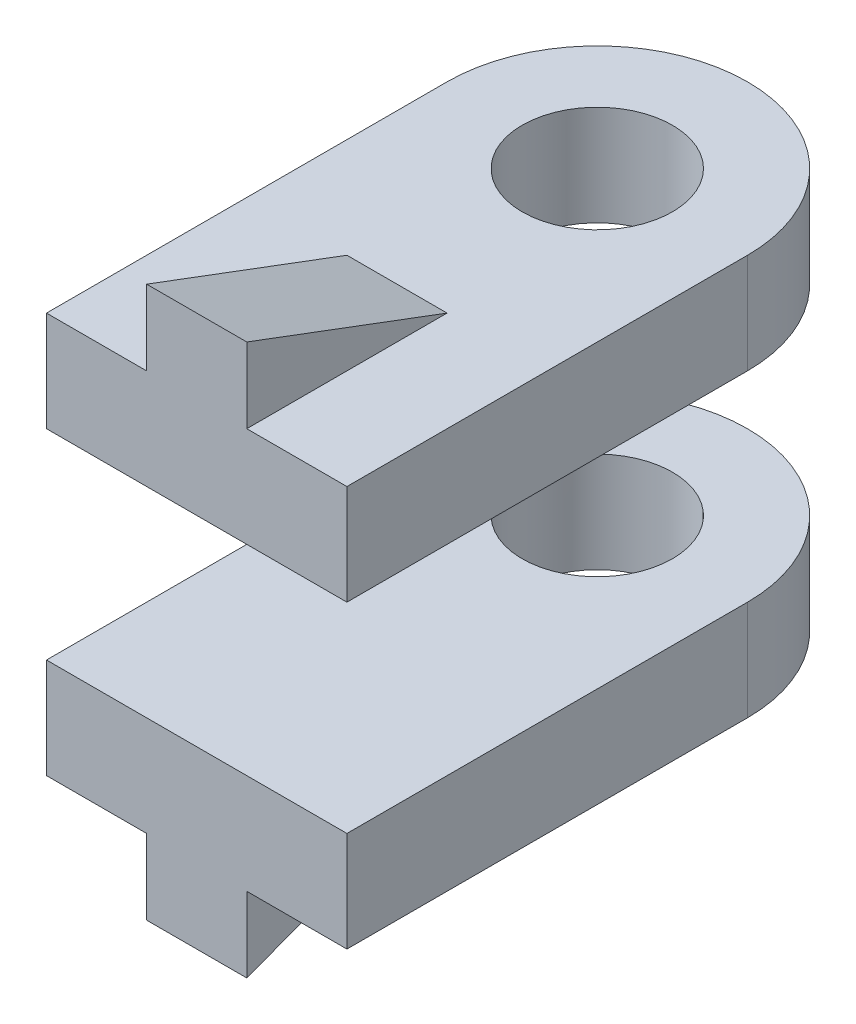
ISO-10303-21;
HEADER;
FILE_DESCRIPTION(('STEP AP214'),'2;1');
FILE_NAME('part.step','',(''),(''),'','','');
FILE_SCHEMA(('AUTOMOTIVE_DESIGN { 1 0 10303 214 1 1 1 1 }'));
ENDSEC;
DATA;
#1=APPLICATION_CONTEXT('core data for automotive mechanical design processes');
#2=APPLICATION_PROTOCOL_DEFINITION('international standard','automotive_design',2000,#1);
#3=PRODUCT_CONTEXT('',#1,'mechanical');
#4=PRODUCT('Part','Part','',(#3));
#5=PRODUCT_RELATED_PRODUCT_CATEGORY('part','',(#4));
#6=PRODUCT_DEFINITION_FORMATION('','',#4);
#7=PRODUCT_DEFINITION_CONTEXT('part definition',#1,'design');
#8=PRODUCT_DEFINITION('design','',#6,#7);
#9=PRODUCT_DEFINITION_SHAPE('','',#8);
#10=(LENGTH_UNIT() NAMED_UNIT(*) SI_UNIT(.MILLI.,.METRE.));
#11=(NAMED_UNIT(*) PLANE_ANGLE_UNIT() SI_UNIT($,.RADIAN.));
#12=(NAMED_UNIT(*) SI_UNIT($,.STERADIAN.) SOLID_ANGLE_UNIT());
#13=UNCERTAINTY_MEASURE_WITH_UNIT(LENGTH_MEASURE(1.E-05),#10,'distance_accuracy_value','');
#14=(GEOMETRIC_REPRESENTATION_CONTEXT(3) GLOBAL_UNCERTAINTY_ASSIGNED_CONTEXT((#13)) GLOBAL_UNIT_ASSIGNED_CONTEXT((#10,
#11,#12)) REPRESENTATION_CONTEXT('',''));
#15=CARTESIAN_POINT('',(0.,0.,0.));
#16=DIRECTION('',(0.,0.,1.));
#17=DIRECTION('',(1.,0.,0.));
#18=AXIS2_PLACEMENT_3D('',#15,#16,#17);
#19=CARTESIAN_POINT('',(-30.,40.,0.));
#20=DIRECTION('',(0.,0.,-1.));
#21=DIRECTION('',(-1.,0.,0.));
#22=AXIS2_PLACEMENT_3D('',#19,#20,#21);
#23=PLANE('',#22);
#24=DIRECTION('',(0.,-1.,0.));
#25=VECTOR('',#24,1.);
#26=CARTESIAN_POINT('',(-30.,40.,0.));
#27=LINE('',#26,#25);
#28=CARTESIAN_POINT('',(-30.,40.,0.));
#29=VERTEX_POINT('',#28);
#30=CARTESIAN_POINT('',(-30.,20.,0.));
#31=VERTEX_POINT('',#30);
#32=EDGE_CURVE('E51',#29,#31,#27,.T.);
#33=ORIENTED_EDGE('',*,*,#32,.T.);
#34=DIRECTION('',(-1.,0.,0.));
#35=VECTOR('',#34,1.);
#36=CARTESIAN_POINT('',(30.,20.,0.));
#37=LINE('',#36,#35);
#38=CARTESIAN_POINT('',(30.,20.,0.));
#39=VERTEX_POINT('',#38);
#40=EDGE_CURVE('E12',#39,#31,#37,.T.);
#41=ORIENTED_EDGE('',*,*,#40,.F.);
#42=DIRECTION('',(0.,-1.,0.));
#43=VECTOR('',#42,1.);
#44=CARTESIAN_POINT('',(30.,40.,0.));
#45=LINE('',#44,#43);
#46=CARTESIAN_POINT('',(30.,40.,0.));
#47=VERTEX_POINT('',#46);
#48=EDGE_CURVE('E164',#47,#39,#45,.T.);
#49=ORIENTED_EDGE('',*,*,#48,.F.);
#50=DIRECTION('',(1.,0.,0.));
#51=VECTOR('',#50,1.);
#52=CARTESIAN_POINT('',(-30.,40.,0.));
#53=LINE('',#52,#51);
#54=CARTESIAN_POINT('',(10.,40.,0.));
#55=VERTEX_POINT('',#54);
#56=EDGE_CURVE('E100',#55,#47,#53,.T.);
#57=ORIENTED_EDGE('',*,*,#56,.F.);
#58=DIRECTION('',(0.,1.,0.));
#59=VECTOR('',#58,1.);
#60=CARTESIAN_POINT('',(10.,40.,0.));
#61=LINE('',#60,#59);
#62=CARTESIAN_POINT('',(10.,55.,0.));
#63=VERTEX_POINT('',#62);
#64=EDGE_CURVE('E136',#55,#63,#61,.T.);
#65=ORIENTED_EDGE('',*,*,#64,.T.);
#66=DIRECTION('',(1.,0.,0.));
#67=VECTOR('',#66,1.);
#68=CARTESIAN_POINT('',(-10.,55.,0.));
#69=LINE('',#68,#67);
#70=CARTESIAN_POINT('',(-10.,55.,0.));
#71=VERTEX_POINT('',#70);
#72=EDGE_CURVE('E121',#71,#63,#69,.T.);
#73=ORIENTED_EDGE('',*,*,#72,.F.);
#74=DIRECTION('',(0.,1.,0.));
#75=VECTOR('',#74,1.);
#76=CARTESIAN_POINT('',(-10.,40.,0.));
#77=LINE('',#76,#75);
#78=CARTESIAN_POINT('',(-10.,40.,0.));
#79=VERTEX_POINT('',#78);
#80=EDGE_CURVE('E127',#79,#71,#77,.T.);
#81=ORIENTED_EDGE('',*,*,#80,.F.);
#82=EDGE_CURVE('E153',#29,#79,#53,.T.);
#83=ORIENTED_EDGE('',*,*,#82,.F.);
#84=EDGE_LOOP('',(#33,#41,#49,#57,#65,#73,#81,#83));
#85=FACE_BOUND('',#84,.T.);
#86=ADVANCED_FACE('F47',(#85),#23,.F.);
#87=CARTESIAN_POINT('',(30.,40.,0.));
#88=DIRECTION('',(-1.,0.,0.));
#89=DIRECTION('',(0.,0.,1.));
#90=AXIS2_PLACEMENT_3D('',#87,#88,#89);
#91=PLANE('',#90);
#92=ORIENTED_EDGE('',*,*,#48,.T.);
#93=DIRECTION('',(0.,0.,1.));
#94=VECTOR('',#93,1.);
#95=CARTESIAN_POINT('',(30.,20.,-110.));
#96=LINE('',#95,#94);
#97=CARTESIAN_POINT('',(30.,20.,-80.));
#98=VERTEX_POINT('',#97);
#99=EDGE_CURVE('E56',#98,#39,#96,.T.);
#100=ORIENTED_EDGE('',*,*,#99,.F.);
#101=DIRECTION('',(0.,-1.,0.));
#102=VECTOR('',#101,1.);
#103=CARTESIAN_POINT('',(30.,40.,-80.));
#104=LINE('',#103,#102);
#105=CARTESIAN_POINT('',(30.,40.,-80.));
#106=VERTEX_POINT('',#105);
#107=EDGE_CURVE('E148',#106,#98,#104,.T.);
#108=ORIENTED_EDGE('',*,*,#107,.F.);
#109=DIRECTION('',(0.,0.,-1.));
#110=VECTOR('',#109,1.);
#111=CARTESIAN_POINT('',(30.,40.,0.));
#112=LINE('',#111,#110);
#113=EDGE_CURVE('E151',#47,#106,#112,.T.);
#114=ORIENTED_EDGE('',*,*,#113,.F.);
#115=EDGE_LOOP('',(#92,#100,#108,#114));
#116=FACE_BOUND('',#115,.T.);
#117=ADVANCED_FACE('F179',(#116),#91,.F.);
#118=CARTESIAN_POINT('',(-30.,40.,0.));
#119=DIRECTION('',(1.,0.,0.));
#120=DIRECTION('',(0.,0.,-1.));
#121=AXIS2_PLACEMENT_3D('',#118,#119,#120);
#122=PLANE('',#121);
#123=DIRECTION('',(0.,-1.,0.));
#124=VECTOR('',#123,1.);
#125=CARTESIAN_POINT('',(-30.,40.,-80.));
#126=LINE('',#125,#124);
#127=CARTESIAN_POINT('',(-30.,40.,-80.));
#128=VERTEX_POINT('',#127);
#129=CARTESIAN_POINT('',(-30.,20.,-80.));
#130=VERTEX_POINT('',#129);
#131=EDGE_CURVE('E162',#128,#130,#126,.T.);
#132=ORIENTED_EDGE('',*,*,#131,.T.);
#133=DIRECTION('',(0.,0.,1.));
#134=VECTOR('',#133,1.);
#135=CARTESIAN_POINT('',(-30.,20.,-110.));
#136=LINE('',#135,#134);
#137=EDGE_CURVE('E158',#130,#31,#136,.T.);
#138=ORIENTED_EDGE('',*,*,#137,.T.);
#139=ORIENTED_EDGE('',*,*,#32,.F.);
#140=DIRECTION('',(0.,0.,1.));
#141=VECTOR('',#140,1.);
#142=CARTESIAN_POINT('',(-30.,40.,0.));
#143=LINE('',#142,#141);
#144=EDGE_CURVE('E89',#128,#29,#143,.T.);
#145=ORIENTED_EDGE('',*,*,#144,.F.);
#146=EDGE_LOOP('',(#132,#138,#139,#145));
#147=FACE_BOUND('',#146,.T.);
#148=ADVANCED_FACE('F171',(#147),#122,.F.);
#149=CARTESIAN_POINT('',(0.,40.,-80.));
#150=DIRECTION('',(0.,-1.,0.));
#151=DIRECTION('',(0.,0.,-1.));
#152=AXIS2_PLACEMENT_3D('',#149,#150,#151);
#153=CYLINDRICAL_SURFACE('',#152,15.);
#154=CARTESIAN_POINT('',(0.,20.,-80.));
#155=DIRECTION('',(0.,1.,0.));
#156=DIRECTION('',(-1.,0.,0.));
#157=AXIS2_PLACEMENT_3D('',#154,#155,#156);
#158=CIRCLE('',#157,15.);
#159=CARTESIAN_POINT('',(-15.,20.,-80.));
#160=VERTEX_POINT('',#159);
#161=EDGE_CURVE('E144',#160,#160,#158,.T.);
#162=ORIENTED_EDGE('',*,*,#161,.F.);
#163=EDGE_LOOP('',(#162));
#164=FACE_BOUND('',#163,.T.);
#165=CARTESIAN_POINT('',(0.,40.,-80.));
#166=DIRECTION('',(0.,1.,0.));
#167=DIRECTION('',(0.,0.,1.));
#168=AXIS2_PLACEMENT_3D('',#165,#166,#167);
#169=CIRCLE('',#168,15.);
#170=CARTESIAN_POINT('',(0.,40.,-65.));
#171=VERTEX_POINT('',#170);
#172=EDGE_CURVE('E155',#171,#171,#169,.T.);
#173=ORIENTED_EDGE('',*,*,#172,.T.);
#174=EDGE_LOOP('',(#173));
#175=FACE_BOUND('',#174,.T.);
#176=ADVANCED_FACE('F49',(#164,#175),#153,.F.);
#177=CARTESIAN_POINT('',(0.,40.,-80.));
#178=DIRECTION('',(0.,-1.,0.));
#179=DIRECTION('',(0.,0.,-1.));
#180=AXIS2_PLACEMENT_3D('',#177,#178,#179);
#181=PLANE('',#180);
#182=DIRECTION('',(1.,0.,0.));
#183=VECTOR('',#182,1.);
#184=CARTESIAN_POINT('',(-10.,40.,-40.));
#185=LINE('',#184,#183);
#186=CARTESIAN_POINT('',(-10.,40.,-40.));
#187=VERTEX_POINT('',#186);
#188=CARTESIAN_POINT('',(10.,40.,-40.));
#189=VERTEX_POINT('',#188);
#190=EDGE_CURVE('E124',#187,#189,#185,.T.);
#191=ORIENTED_EDGE('',*,*,#190,.T.);
#192=DIRECTION('',(0.,0.,1.));
#193=VECTOR('',#192,1.);
#194=CARTESIAN_POINT('',(10.,40.,-40.));
#195=LINE('',#194,#193);
#196=EDGE_CURVE('E64',#189,#55,#195,.T.);
#197=ORIENTED_EDGE('',*,*,#196,.T.);
#198=ORIENTED_EDGE('',*,*,#56,.T.);
#199=ORIENTED_EDGE('',*,*,#113,.T.);
#200=CARTESIAN_POINT('',(0.,40.,-80.));
#201=DIRECTION('',(0.,1.,0.));
#202=DIRECTION('',(0.,0.,-1.));
#203=AXIS2_PLACEMENT_3D('',#200,#201,#202);
#204=CIRCLE('',#203,30.);
#205=EDGE_CURVE('E149',#106,#128,#204,.T.);
#206=ORIENTED_EDGE('',*,*,#205,.T.);
#207=ORIENTED_EDGE('',*,*,#144,.T.);
#208=ORIENTED_EDGE('',*,*,#82,.T.);
#209=DIRECTION('',(0.,0.,1.));
#210=VECTOR('',#209,1.);
#211=CARTESIAN_POINT('',(-10.,40.,-40.));
#212=LINE('',#211,#210);
#213=EDGE_CURVE('E128',#187,#79,#212,.T.);
#214=ORIENTED_EDGE('',*,*,#213,.F.);
#215=EDGE_LOOP('',(#191,#197,#198,#199,#206,#207,#208,#214));
#216=FACE_BOUND('',#215,.T.);
#217=ORIENTED_EDGE('',*,*,#172,.F.);
#218=EDGE_LOOP('',(#217));
#219=FACE_BOUND('',#218,.T.);
#220=ADVANCED_FACE('F180',(#216,#219),#181,.F.);
#221=CARTESIAN_POINT('',(0.,40.,-80.));
#222=DIRECTION('',(0.,-1.,0.));
#223=DIRECTION('',(0.,0.,-1.));
#224=AXIS2_PLACEMENT_3D('',#221,#222,#223);
#225=CYLINDRICAL_SURFACE('',#224,30.);
#226=ORIENTED_EDGE('',*,*,#107,.T.);
#227=CARTESIAN_POINT('',(0.,20.,-80.));
#228=DIRECTION('',(0.,1.,0.));
#229=DIRECTION('',(-1.,0.,0.));
#230=AXIS2_PLACEMENT_3D('',#227,#228,#229);
#231=CIRCLE('',#230,30.);
#232=EDGE_CURVE('E73',#98,#130,#231,.T.);
#233=ORIENTED_EDGE('',*,*,#232,.T.);
#234=ORIENTED_EDGE('',*,*,#131,.F.);
#235=ORIENTED_EDGE('',*,*,#205,.F.);
#236=EDGE_LOOP('',(#226,#233,#234,#235));
#237=FACE_BOUND('',#236,.T.);
#238=ADVANCED_FACE('F174',(#237),#225,.T.);
#239=CARTESIAN_POINT('',(30.,20.,-110.));
#240=DIRECTION('',(0.,1.,0.));
#241=DIRECTION('',(-1.,0.,0.));
#242=AXIS2_PLACEMENT_3D('',#239,#240,#241);
#243=PLANE('',#242);
#244=ORIENTED_EDGE('',*,*,#161,.T.);
#245=EDGE_LOOP('',(#244));
#246=FACE_BOUND('',#245,.T.);
#247=ORIENTED_EDGE('',*,*,#99,.T.);
#248=ORIENTED_EDGE('',*,*,#40,.T.);
#249=ORIENTED_EDGE('',*,*,#137,.F.);
#250=ORIENTED_EDGE('',*,*,#232,.F.);
#251=EDGE_LOOP('',(#247,#248,#249,#250));
#252=FACE_BOUND('',#251,.T.);
#253=ADVANCED_FACE('F176',(#246,#252),#243,.F.);
#254=CARTESIAN_POINT('',(-10.,55.,0.));
#255=DIRECTION('',(0.,-0.936329177569045,0.351123441588392));
#256=DIRECTION('',(0.,-0.351123441588392,-0.936329177569045));
#257=AXIS2_PLACEMENT_3D('',#254,#255,#256);
#258=PLANE('',#257);
#259=DIRECTION('',(0.,-0.351123441588392,-0.936329177569045));
#260=VECTOR('',#259,1.);
#261=CARTESIAN_POINT('',(10.,55.,0.));
#262=LINE('',#261,#260);
#263=EDGE_CURVE('E104',#63,#189,#262,.T.);
#264=ORIENTED_EDGE('',*,*,#263,.T.);
#265=ORIENTED_EDGE('',*,*,#190,.F.);
#266=DIRECTION('',(0.,-0.351123441588392,-0.936329177569045));
#267=VECTOR('',#266,1.);
#268=CARTESIAN_POINT('',(-10.,55.,0.));
#269=LINE('',#268,#267);
#270=EDGE_CURVE('E117',#71,#187,#269,.T.);
#271=ORIENTED_EDGE('',*,*,#270,.F.);
#272=ORIENTED_EDGE('',*,*,#72,.T.);
#273=EDGE_LOOP('',(#264,#265,#271,#272));
#274=FACE_BOUND('',#273,.T.);
#275=ADVANCED_FACE('F119',(#274),#258,.F.);
#276=CARTESIAN_POINT('',(-10.,0.,0.));
#277=DIRECTION('',(1.,0.,0.));
#278=DIRECTION('',(0.,0.,-1.));
#279=AXIS2_PLACEMENT_3D('',#276,#277,#278);
#280=PLANE('',#279);
#281=ORIENTED_EDGE('',*,*,#80,.T.);
#282=ORIENTED_EDGE('',*,*,#270,.T.);
#283=ORIENTED_EDGE('',*,*,#213,.T.);
#284=EDGE_LOOP('',(#281,#282,#283));
#285=FACE_BOUND('',#284,.T.);
#286=ADVANCED_FACE('F131',(#285),#280,.F.);
#287=CARTESIAN_POINT('',(10.,0.,0.));
#288=DIRECTION('',(1.,0.,0.));
#289=DIRECTION('',(0.,0.,-1.));
#290=AXIS2_PLACEMENT_3D('',#287,#288,#289);
#291=PLANE('',#290);
#292=ORIENTED_EDGE('',*,*,#64,.F.);
#293=ORIENTED_EDGE('',*,*,#196,.F.);
#294=ORIENTED_EDGE('',*,*,#263,.F.);
#295=EDGE_LOOP('',(#292,#293,#294));
#296=FACE_BOUND('',#295,.T.);
#297=ADVANCED_FACE('F206',(#296),#291,.T.);
#298=CLOSED_SHELL('',(#86,#117,#148,#176,#220,#238,#253,#275,#286,#297));
#299=MANIFOLD_SOLID_BREP('B2',#298);
#300=CARTESIAN_POINT('',(-30.,40.,0.));
#301=DIRECTION('',(1.,0.,0.));
#302=DIRECTION('',(0.,0.,-1.));
#303=AXIS2_PLACEMENT_3D('',#300,#301,#302);
#304=PLANE('',#303);
#305=DIRECTION('',(0.,-1.,0.));
#306=VECTOR('',#305,1.);
#307=CARTESIAN_POINT('',(-30.,40.,0.));
#308=LINE('',#307,#306);
#309=CARTESIAN_POINT('',(-30.,-20.,0.));
#310=VERTEX_POINT('',#309);
#311=CARTESIAN_POINT('',(-30.,-40.,0.));
#312=VERTEX_POINT('',#311);
#313=EDGE_CURVE('E380',#310,#312,#308,.T.);
#314=ORIENTED_EDGE('',*,*,#313,.F.);
#315=DIRECTION('',(0.,0.,1.));
#316=VECTOR('',#315,1.);
#317=CARTESIAN_POINT('',(-30.,-20.,-110.));
#318=LINE('',#317,#316);
#319=CARTESIAN_POINT('',(-30.,-20.,-80.));
#320=VERTEX_POINT('',#319);
#321=EDGE_CURVE('E359',#320,#310,#318,.T.);
#322=ORIENTED_EDGE('',*,*,#321,.F.);
#323=DIRECTION('',(0.,-1.,0.));
#324=VECTOR('',#323,1.);
#325=CARTESIAN_POINT('',(-30.,40.,-80.));
#326=LINE('',#325,#324);
#327=CARTESIAN_POINT('',(-30.,-40.,-80.));
#328=VERTEX_POINT('',#327);
#329=EDGE_CURVE('E382',#320,#328,#326,.T.);
#330=ORIENTED_EDGE('',*,*,#329,.T.);
#331=DIRECTION('',(0.,0.,1.));
#332=VECTOR('',#331,1.);
#333=CARTESIAN_POINT('',(-30.,-40.,0.));
#334=LINE('',#333,#332);
#335=EDGE_CURVE('E377',#328,#312,#334,.T.);
#336=ORIENTED_EDGE('',*,*,#335,.T.);
#337=EDGE_LOOP('',(#314,#322,#330,#336));
#338=FACE_BOUND('',#337,.T.);
#339=ADVANCED_FACE('F272',(#338),#304,.F.);
#340=CARTESIAN_POINT('',(0.,40.,-80.));
#341=DIRECTION('',(0.,-1.,0.));
#342=DIRECTION('',(0.,0.,-1.));
#343=AXIS2_PLACEMENT_3D('',#340,#341,#342);
#344=CYLINDRICAL_SURFACE('',#343,30.);
#345=ORIENTED_EDGE('',*,*,#329,.F.);
#346=CARTESIAN_POINT('',(0.,-20.,-80.));
#347=DIRECTION('',(0.,-1.,0.));
#348=DIRECTION('',(1.,0.,0.));
#349=AXIS2_PLACEMENT_3D('',#346,#347,#348);
#350=CIRCLE('',#349,30.);
#351=CARTESIAN_POINT('',(30.,-20.,-80.));
#352=VERTEX_POINT('',#351);
#353=EDGE_CURVE('E296',#320,#352,#350,.T.);
#354=ORIENTED_EDGE('',*,*,#353,.T.);
#355=DIRECTION('',(0.,-1.,0.));
#356=VECTOR('',#355,1.);
#357=CARTESIAN_POINT('',(30.,40.,-80.));
#358=LINE('',#357,#356);
#359=CARTESIAN_POINT('',(30.,-40.,-80.));
#360=VERTEX_POINT('',#359);
#361=EDGE_CURVE('E281',#352,#360,#358,.T.);
#362=ORIENTED_EDGE('',*,*,#361,.T.);
#363=CARTESIAN_POINT('',(0.,-40.,-80.));
#364=DIRECTION('',(0.,1.,0.));
#365=DIRECTION('',(0.,0.,-1.));
#366=AXIS2_PLACEMENT_3D('',#363,#364,#365);
#367=CIRCLE('',#366,30.);
#368=EDGE_CURVE('E374',#360,#328,#367,.T.);
#369=ORIENTED_EDGE('',*,*,#368,.T.);
#370=EDGE_LOOP('',(#345,#354,#362,#369));
#371=FACE_BOUND('',#370,.T.);
#372=ADVANCED_FACE('F387',(#371),#344,.T.);
#373=CARTESIAN_POINT('',(30.,40.,0.));
#374=DIRECTION('',(-1.,0.,0.));
#375=DIRECTION('',(0.,0.,1.));
#376=AXIS2_PLACEMENT_3D('',#373,#374,#375);
#377=PLANE('',#376);
#378=ORIENTED_EDGE('',*,*,#361,.F.);
#379=DIRECTION('',(0.,0.,1.));
#380=VECTOR('',#379,1.);
#381=CARTESIAN_POINT('',(30.,-20.,-110.));
#382=LINE('',#381,#380);
#383=CARTESIAN_POINT('',(30.,-20.,0.));
#384=VERTEX_POINT('',#383);
#385=EDGE_CURVE('E360',#352,#384,#382,.T.);
#386=ORIENTED_EDGE('',*,*,#385,.T.);
#387=DIRECTION('',(0.,-1.,0.));
#388=VECTOR('',#387,1.);
#389=CARTESIAN_POINT('',(30.,40.,0.));
#390=LINE('',#389,#388);
#391=CARTESIAN_POINT('',(30.,-40.,0.));
#392=VERTEX_POINT('',#391);
#393=EDGE_CURVE('E45',#384,#392,#390,.T.);
#394=ORIENTED_EDGE('',*,*,#393,.T.);
#395=DIRECTION('',(0.,0.,-1.));
#396=VECTOR('',#395,1.);
#397=CARTESIAN_POINT('',(30.,-40.,0.));
#398=LINE('',#397,#396);
#399=EDGE_CURVE('E371',#392,#360,#398,.T.);
#400=ORIENTED_EDGE('',*,*,#399,.T.);
#401=EDGE_LOOP('',(#378,#386,#394,#400));
#402=FACE_BOUND('',#401,.T.);
#403=ADVANCED_FACE('F392',(#402),#377,.F.);
#404=CARTESIAN_POINT('',(-30.,40.,0.));
#405=DIRECTION('',(0.,0.,-1.));
#406=DIRECTION('',(-1.,0.,0.));
#407=AXIS2_PLACEMENT_3D('',#404,#405,#406);
#408=PLANE('',#407);
#409=ORIENTED_EDGE('',*,*,#393,.F.);
#410=DIRECTION('',(1.,0.,0.));
#411=VECTOR('',#410,1.);
#412=CARTESIAN_POINT('',(-30.,-20.,0.));
#413=LINE('',#412,#411);
#414=EDGE_CURVE('E353',#310,#384,#413,.T.);
#415=ORIENTED_EDGE('',*,*,#414,.F.);
#416=ORIENTED_EDGE('',*,*,#313,.T.);
#417=DIRECTION('',(1.,0.,0.));
#418=VECTOR('',#417,1.);
#419=CARTESIAN_POINT('',(-30.,-40.,0.));
#420=LINE('',#419,#418);
#421=CARTESIAN_POINT('',(-10.,-40.,0.));
#422=VERTEX_POINT('',#421);
#423=EDGE_CURVE('E369',#312,#422,#420,.T.);
#424=ORIENTED_EDGE('',*,*,#423,.T.);
#425=DIRECTION('',(0.,-1.,0.));
#426=VECTOR('',#425,1.);
#427=CARTESIAN_POINT('',(-10.,0.,0.));
#428=LINE('',#427,#426);
#429=CARTESIAN_POINT('',(-10.,-55.,0.));
#430=VERTEX_POINT('',#429);
#431=EDGE_CURVE('E288',#422,#430,#428,.T.);
#432=ORIENTED_EDGE('',*,*,#431,.T.);
#433=DIRECTION('',(1.,0.,0.));
#434=VECTOR('',#433,1.);
#435=CARTESIAN_POINT('',(-10.,-55.,0.));
#436=LINE('',#435,#434);
#437=CARTESIAN_POINT('',(10.,-55.,0.));
#438=VERTEX_POINT('',#437);
#439=EDGE_CURVE('E344',#430,#438,#436,.T.);
#440=ORIENTED_EDGE('',*,*,#439,.T.);
#441=DIRECTION('',(0.,-1.,0.));
#442=VECTOR('',#441,1.);
#443=CARTESIAN_POINT('',(10.,0.,0.));
#444=LINE('',#443,#442);
#445=CARTESIAN_POINT('',(10.,-40.,0.));
#446=VERTEX_POINT('',#445);
#447=EDGE_CURVE('E345',#446,#438,#444,.T.);
#448=ORIENTED_EDGE('',*,*,#447,.F.);
#449=EDGE_CURVE('E368',#446,#392,#420,.T.);
#450=ORIENTED_EDGE('',*,*,#449,.T.);
#451=EDGE_LOOP('',(#409,#415,#416,#424,#432,#440,#448,#450));
#452=FACE_BOUND('',#451,.T.);
#453=ADVANCED_FACE('F274',(#452),#408,.F.);
#454=CARTESIAN_POINT('',(0.,-40.,-80.));
#455=DIRECTION('',(0.,-1.,0.));
#456=DIRECTION('',(0.,0.,-1.));
#457=AXIS2_PLACEMENT_3D('',#454,#455,#456);
#458=PLANE('',#457);
#459=DIRECTION('',(0.,0.,1.));
#460=VECTOR('',#459,1.);
#461=CARTESIAN_POINT('',(10.,-40.,0.));
#462=LINE('',#461,#460);
#463=CARTESIAN_POINT('',(10.,-40.,-40.));
#464=VERTEX_POINT('',#463);
#465=EDGE_CURVE('E351',#464,#446,#462,.T.);
#466=ORIENTED_EDGE('',*,*,#465,.F.);
#467=DIRECTION('',(1.,0.,0.));
#468=VECTOR('',#467,1.);
#469=CARTESIAN_POINT('',(-10.,-40.,-40.));
#470=LINE('',#469,#468);
#471=CARTESIAN_POINT('',(-10.,-40.,-40.));
#472=VERTEX_POINT('',#471);
#473=EDGE_CURVE('E342',#472,#464,#470,.T.);
#474=ORIENTED_EDGE('',*,*,#473,.F.);
#475=DIRECTION('',(0.,0.,1.));
#476=VECTOR('',#475,1.);
#477=CARTESIAN_POINT('',(-10.,-40.,0.));
#478=LINE('',#477,#476);
#479=EDGE_CURVE('E330',#472,#422,#478,.T.);
#480=ORIENTED_EDGE('',*,*,#479,.T.);
#481=ORIENTED_EDGE('',*,*,#423,.F.);
#482=ORIENTED_EDGE('',*,*,#335,.F.);
#483=ORIENTED_EDGE('',*,*,#368,.F.);
#484=ORIENTED_EDGE('',*,*,#399,.F.);
#485=ORIENTED_EDGE('',*,*,#449,.F.);
#486=EDGE_LOOP('',(#466,#474,#480,#481,#482,#483,#484,#485));
#487=FACE_BOUND('',#486,.T.);
#488=CARTESIAN_POINT('',(0.,-40.,-80.));
#489=DIRECTION('',(0.,1.,0.));
#490=DIRECTION('',(0.,0.,1.));
#491=AXIS2_PLACEMENT_3D('',#488,#489,#490);
#492=CIRCLE('',#491,15.);
#493=CARTESIAN_POINT('',(0.,-40.,-65.));
#494=VERTEX_POINT('',#493);
#495=EDGE_CURVE('E365',#494,#494,#492,.T.);
#496=ORIENTED_EDGE('',*,*,#495,.T.);
#497=EDGE_LOOP('',(#496));
#498=FACE_BOUND('',#497,.T.);
#499=ADVANCED_FACE('F348',(#487,#498),#458,.T.);
#500=CARTESIAN_POINT('',(0.,40.,-80.));
#501=DIRECTION('',(0.,-1.,0.));
#502=DIRECTION('',(0.,0.,-1.));
#503=AXIS2_PLACEMENT_3D('',#500,#501,#502);
#504=CYLINDRICAL_SURFACE('',#503,15.);
#505=CARTESIAN_POINT('',(0.,-20.,-80.));
#506=DIRECTION('',(0.,-1.,0.));
#507=DIRECTION('',(1.,0.,0.));
#508=AXIS2_PLACEMENT_3D('',#505,#506,#507);
#509=CIRCLE('',#508,15.);
#510=CARTESIAN_POINT('',(15.,-20.,-80.));
#511=VERTEX_POINT('',#510);
#512=EDGE_CURVE('E276',#511,#511,#509,.T.);
#513=ORIENTED_EDGE('',*,*,#512,.F.);
#514=EDGE_LOOP('',(#513));
#515=FACE_BOUND('',#514,.T.);
#516=ORIENTED_EDGE('',*,*,#495,.F.);
#517=EDGE_LOOP('',(#516));
#518=FACE_BOUND('',#517,.T.);
#519=ADVANCED_FACE('F428',(#515,#518),#504,.F.);
#520=CARTESIAN_POINT('',(-30.,-20.,-110.));
#521=DIRECTION('',(0.,-1.,0.));
#522=DIRECTION('',(1.,0.,0.));
#523=AXIS2_PLACEMENT_3D('',#520,#521,#522);
#524=PLANE('',#523);
#525=ORIENTED_EDGE('',*,*,#512,.T.);
#526=EDGE_LOOP('',(#525));
#527=FACE_BOUND('',#526,.T.);
#528=ORIENTED_EDGE('',*,*,#321,.T.);
#529=ORIENTED_EDGE('',*,*,#414,.T.);
#530=ORIENTED_EDGE('',*,*,#385,.F.);
#531=ORIENTED_EDGE('',*,*,#353,.F.);
#532=EDGE_LOOP('',(#528,#529,#530,#531));
#533=FACE_BOUND('',#532,.T.);
#534=ADVANCED_FACE('F397',(#527,#533),#524,.F.);
#535=CARTESIAN_POINT('',(-10.,-48.2191780821918,-18.0821917808219));
#536=DIRECTION('',(0.,-0.936329177569045,-0.351123441588392));
#537=DIRECTION('',(0.,0.351123441588392,-0.936329177569045));
#538=AXIS2_PLACEMENT_3D('',#535,#536,#537);
#539=PLANE('',#538);
#540=DIRECTION('',(0.,0.351123441588392,-0.936329177569045));
#541=VECTOR('',#540,1.);
#542=CARTESIAN_POINT('',(10.,-48.2191780821918,-18.0821917808219));
#543=LINE('',#542,#541);
#544=EDGE_CURVE('E402',#438,#464,#543,.T.);
#545=ORIENTED_EDGE('',*,*,#544,.F.);
#546=ORIENTED_EDGE('',*,*,#439,.F.);
#547=DIRECTION('',(0.,0.351123441588392,-0.936329177569045));
#548=VECTOR('',#547,1.);
#549=CARTESIAN_POINT('',(-10.,-48.2191780821918,-18.0821917808219));
#550=LINE('',#549,#548);
#551=EDGE_CURVE('E333',#430,#472,#550,.T.);
#552=ORIENTED_EDGE('',*,*,#551,.T.);
#553=ORIENTED_EDGE('',*,*,#473,.T.);
#554=EDGE_LOOP('',(#545,#546,#552,#553));
#555=FACE_BOUND('',#554,.T.);
#556=ADVANCED_FACE('F341',(#555),#539,.T.);
#557=CARTESIAN_POINT('',(-10.,0.,0.));
#558=DIRECTION('',(1.,0.,0.));
#559=DIRECTION('',(0.,0.,-1.));
#560=AXIS2_PLACEMENT_3D('',#557,#558,#559);
#561=PLANE('',#560);
#562=ORIENTED_EDGE('',*,*,#551,.F.);
#563=ORIENTED_EDGE('',*,*,#431,.F.);
#564=ORIENTED_EDGE('',*,*,#479,.F.);
#565=EDGE_LOOP('',(#562,#563,#564));
#566=FACE_BOUND('',#565,.T.);
#567=ADVANCED_FACE('F332',(#566),#561,.F.);
#568=CARTESIAN_POINT('',(10.,0.,0.));
#569=DIRECTION('',(1.,0.,0.));
#570=DIRECTION('',(0.,0.,-1.));
#571=AXIS2_PLACEMENT_3D('',#568,#569,#570);
#572=PLANE('',#571);
#573=ORIENTED_EDGE('',*,*,#544,.T.);
#574=ORIENTED_EDGE('',*,*,#465,.T.);
#575=ORIENTED_EDGE('',*,*,#447,.T.);
#576=EDGE_LOOP('',(#573,#574,#575));
#577=FACE_BOUND('',#576,.T.);
#578=ADVANCED_FACE('F405',(#577),#572,.T.);
#579=CLOSED_SHELL('',(#339,#372,#403,#453,#499,#519,#534,#556,#567,#578));
#580=MANIFOLD_SOLID_BREP('B6',#579);
#581=ADVANCED_BREP_SHAPE_REPRESENTATION('',(#18,#299,#580),#14);
#582=SHAPE_DEFINITION_REPRESENTATION(#9,#581);
ENDSEC;
END-ISO-10303-21;
